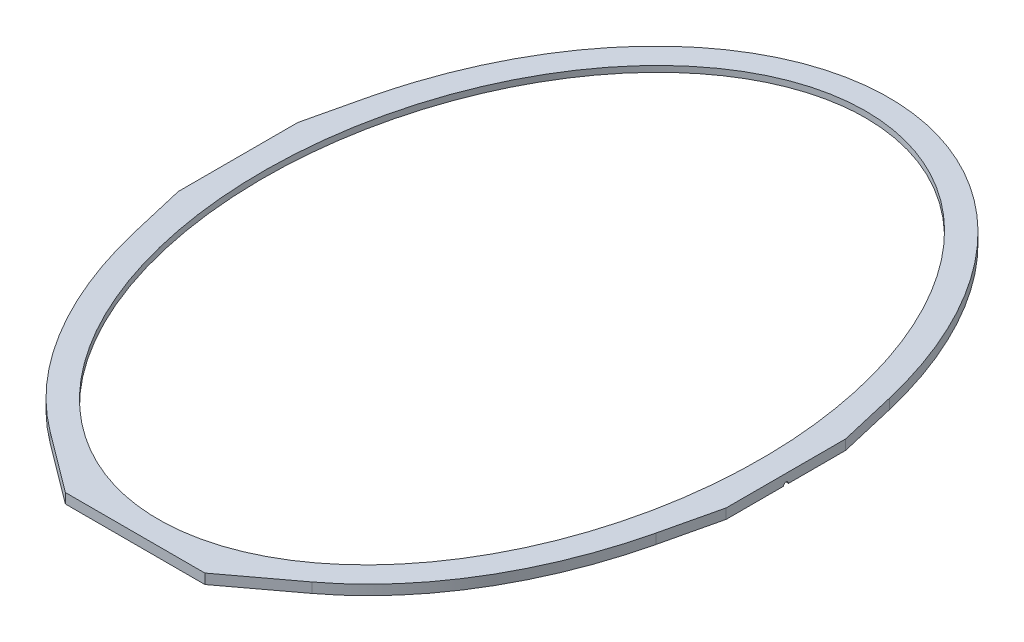
ISO-10303-21;
HEADER;
FILE_DESCRIPTION(('STEP AP214'),'2;1');
FILE_NAME('part.step','',(''),(''),'','','');
FILE_SCHEMA(('AUTOMOTIVE_DESIGN { 1 0 10303 214 1 1 1 1 }'));
ENDSEC;
DATA;
#1=APPLICATION_CONTEXT('core data for automotive mechanical design processes');
#2=APPLICATION_PROTOCOL_DEFINITION('international standard','automotive_design',2000,#1);
#3=PRODUCT_CONTEXT('',#1,'mechanical');
#4=PRODUCT('Part','Part','',(#3));
#5=PRODUCT_RELATED_PRODUCT_CATEGORY('part','',(#4));
#6=PRODUCT_DEFINITION_FORMATION('','',#4);
#7=PRODUCT_DEFINITION_CONTEXT('part definition',#1,'design');
#8=PRODUCT_DEFINITION('design','',#6,#7);
#9=PRODUCT_DEFINITION_SHAPE('','',#8);
#10=(LENGTH_UNIT() NAMED_UNIT(*) SI_UNIT(.MILLI.,.METRE.));
#11=(NAMED_UNIT(*) PLANE_ANGLE_UNIT() SI_UNIT($,.RADIAN.));
#12=(NAMED_UNIT(*) SI_UNIT($,.STERADIAN.) SOLID_ANGLE_UNIT());
#13=UNCERTAINTY_MEASURE_WITH_UNIT(LENGTH_MEASURE(1.E-05),#10,'distance_accuracy_value','');
#14=(GEOMETRIC_REPRESENTATION_CONTEXT(3) GLOBAL_UNCERTAINTY_ASSIGNED_CONTEXT((#13)) GLOBAL_UNIT_ASSIGNED_CONTEXT((#10,
#11,#12)) REPRESENTATION_CONTEXT('',''));
#15=CARTESIAN_POINT('',(0.,0.,0.));
#16=DIRECTION('',(0.,0.,1.));
#17=DIRECTION('',(1.,0.,0.));
#18=AXIS2_PLACEMENT_3D('',#15,#16,#17);
#19=CARTESIAN_POINT('',(0.,10.,0.));
#20=DIRECTION('',(0.,1.,0.));
#21=DIRECTION('',(0.,0.,1.));
#22=AXIS2_PLACEMENT_3D('',#19,#20,#21);
#23=ELLIPSE('',#22,378.303394114485,275.129741174171);
#24=DIRECTION('',(0.,-1.,0.));
#25=VECTOR('',#24,1.);
#26=SURFACE_OF_LINEAR_EXTRUSION('',#23,#25);
#27=CARTESIAN_POINT('',(0.,0.,0.));
#28=DIRECTION('',(0.,1.,0.));
#29=DIRECTION('',(0.,0.,1.));
#30=AXIS2_PLACEMENT_3D('',#27,#28,#29);
#31=ELLIPSE('',#30,378.303394114485,275.129741174171);
#32=CARTESIAN_POINT('',(-261.621621621622,0.,117.081081081081));
#33=VERTEX_POINT('',#32);
#34=CARTESIAN_POINT('',(-131.488450883328,0.,332.304138114354));
#35=VERTEX_POINT('',#34);
#36=EDGE_CURVE('E303',#33,#35,#31,.T.);
#37=ORIENTED_EDGE('',*,*,#36,.T.);
#38=DIRECTION('',(0.,1.,0.));
#39=VECTOR('',#38,1.);
#40=CARTESIAN_POINT('',(-131.488450883328,0.,332.304138114354));
#41=LINE('',#40,#39);
#42=CARTESIAN_POINT('',(-131.488450883328,10.,332.304138114354));
#43=VERTEX_POINT('',#42);
#44=EDGE_CURVE('E223',#35,#43,#41,.T.);
#45=ORIENTED_EDGE('',*,*,#44,.T.);
#46=CARTESIAN_POINT('',(-261.621621621622,10.,117.081081081081));
#47=VERTEX_POINT('',#46);
#48=EDGE_CURVE('E271',#47,#43,#23,.T.);
#49=ORIENTED_EDGE('',*,*,#48,.F.);
#50=DIRECTION('',(0.,-1.,0.));
#51=VECTOR('',#50,1.);
#52=CARTESIAN_POINT('',(-261.621621621622,10.,117.081081081081));
#53=LINE('',#52,#51);
#54=EDGE_CURVE('E306',#47,#33,#53,.T.);
#55=ORIENTED_EDGE('',*,*,#54,.T.);
#56=EDGE_LOOP('',(#37,#45,#49,#55));
#57=FACE_BOUND('',#56,.T.);
#58=ADVANCED_FACE('F32',(#57),#26,.F.);
#59=CARTESIAN_POINT('',(0.,10.,0.));
#60=DIRECTION('',(0.,1.,0.));
#61=DIRECTION('',(0.,0.,-1.));
#62=AXIS2_PLACEMENT_3D('',#59,#60,#61);
#63=ELLIPSE('',#62,355.,250.);
#64=DIRECTION('',(0.,-1.,0.));
#65=VECTOR('',#64,1.);
#66=SURFACE_OF_LINEAR_EXTRUSION('',#63,#65);
#67=CARTESIAN_POINT('',(0.,10.,-355.));
#68=VERTEX_POINT('',#67);
#69=EDGE_CURVE('E241',#68,#68,#63,.T.);
#70=ORIENTED_EDGE('',*,*,#69,.T.);
#71=EDGE_LOOP('',(#70));
#72=FACE_BOUND('',#71,.T.);
#73=CARTESIAN_POINT('',(0.,4.,0.));
#74=DIRECTION('',(0.,-1.,0.));
#75=DIRECTION('',(0.,0.,1.));
#76=AXIS2_PLACEMENT_3D('',#73,#74,#75);
#77=ELLIPSE('',#76,355.,250.);
#78=CARTESIAN_POINT('',(0.,4.,355.));
#79=VERTEX_POINT('',#78);
#80=EDGE_CURVE('E234',#79,#79,#77,.T.);
#81=ORIENTED_EDGE('',*,*,#80,.T.);
#82=EDGE_LOOP('',(#81));
#83=FACE_BOUND('',#82,.T.);
#84=ADVANCED_FACE('F252',(#72,#83),#66,.T.);
#85=CARTESIAN_POINT('',(0.,10.,0.));
#86=DIRECTION('',(0.,-1.,0.));
#87=DIRECTION('',(0.,0.,-1.));
#88=AXIS2_PLACEMENT_3D('',#85,#86,#87);
#89=PLANE('',#88);
#90=ORIENTED_EDGE('',*,*,#48,.T.);
#91=DIRECTION('',(0.800731260144117,0.,0.599023746631145));
#92=VECTOR('',#91,1.);
#93=CARTESIAN_POINT('',(-70.,10.,378.303394114484));
#94=LINE('',#93,#92);
#95=CARTESIAN_POINT('',(-70.,10.,378.303394114484));
#96=VERTEX_POINT('',#95);
#97=EDGE_CURVE('E212',#43,#96,#94,.T.);
#98=ORIENTED_EDGE('',*,*,#97,.T.);
#99=DIRECTION('',(1.,0.,0.));
#100=VECTOR('',#99,1.);
#101=CARTESIAN_POINT('',(70.,10.,378.303394114484));
#102=LINE('',#101,#100);
#103=CARTESIAN_POINT('',(70.,10.,378.303394114484));
#104=VERTEX_POINT('',#103);
#105=EDGE_CURVE('E199',#96,#104,#102,.T.);
#106=ORIENTED_EDGE('',*,*,#105,.T.);
#107=DIRECTION('',(0.800731260144117,0.,-0.599023746631145));
#108=VECTOR('',#107,1.);
#109=CARTESIAN_POINT('',(70.,10.,378.303394114484));
#110=LINE('',#109,#108);
#111=CARTESIAN_POINT('',(131.488450883328,10.,332.304138114354));
#112=VERTEX_POINT('',#111);
#113=EDGE_CURVE('E193',#104,#112,#110,.T.);
#114=ORIENTED_EDGE('',*,*,#113,.T.);
#115=CARTESIAN_POINT('',(261.621621621622,10.,117.081081081081));
#116=VERTEX_POINT('',#115);
#117=EDGE_CURVE('E270',#112,#116,#23,.T.);
#118=ORIENTED_EDGE('',*,*,#117,.T.);
#119=DIRECTION('',(0.228191322789328,0.,-0.973616310567801));
#120=VECTOR('',#119,1.);
#121=CARTESIAN_POINT('',(275.,10.,60.));
#122=LINE('',#121,#120);
#123=CARTESIAN_POINT('',(275.,10.,60.));
#124=VERTEX_POINT('',#123);
#125=EDGE_CURVE('E275',#116,#124,#122,.T.);
#126=ORIENTED_EDGE('',*,*,#125,.T.);
#127=DIRECTION('',(0.,0.,-1.));
#128=VECTOR('',#127,1.);
#129=CARTESIAN_POINT('',(275.,10.,-60.));
#130=LINE('',#129,#128);
#131=CARTESIAN_POINT('',(275.,10.,-60.));
#132=VERTEX_POINT('',#131);
#133=EDGE_CURVE('E429',#124,#132,#130,.T.);
#134=ORIENTED_EDGE('',*,*,#133,.T.);
#135=DIRECTION('',(-0.228191322789328,0.,-0.973616310567801));
#136=VECTOR('',#135,1.);
#137=CARTESIAN_POINT('',(275.,10.,-60.));
#138=LINE('',#137,#136);
#139=CARTESIAN_POINT('',(261.621621621622,10.,-117.081081081081));
#140=VERTEX_POINT('',#139);
#141=EDGE_CURVE('E373',#132,#140,#138,.T.);
#142=ORIENTED_EDGE('',*,*,#141,.T.);
#143=CARTESIAN_POINT('',(0.,10.,0.));
#144=DIRECTION('',(0.,1.,0.));
#145=DIRECTION('',(0.,0.,-1.));
#146=AXIS2_PLACEMENT_3D('',#143,#144,#145);
#147=ELLIPSE('',#146,378.303394114485,275.129741174171);
#148=CARTESIAN_POINT('',(-261.621621621622,10.,-117.081081081081));
#149=VERTEX_POINT('',#148);
#150=EDGE_CURVE('E327',#140,#149,#147,.T.);
#151=ORIENTED_EDGE('',*,*,#150,.T.);
#152=DIRECTION('',(-0.228191322789328,0.,0.973616310567801));
#153=VECTOR('',#152,1.);
#154=CARTESIAN_POINT('',(-275.,10.,-60.));
#155=LINE('',#154,#153);
#156=CARTESIAN_POINT('',(-275.,10.,-60.));
#157=VERTEX_POINT('',#156);
#158=EDGE_CURVE('E262',#149,#157,#155,.T.);
#159=ORIENTED_EDGE('',*,*,#158,.T.);
#160=DIRECTION('',(0.,0.,1.));
#161=VECTOR('',#160,1.);
#162=CARTESIAN_POINT('',(-275.,10.,-60.));
#163=LINE('',#162,#161);
#164=CARTESIAN_POINT('',(-275.,10.,60.));
#165=VERTEX_POINT('',#164);
#166=EDGE_CURVE('E265',#157,#165,#163,.T.);
#167=ORIENTED_EDGE('',*,*,#166,.T.);
#168=DIRECTION('',(0.228191322789328,0.,0.973616310567801));
#169=VECTOR('',#168,1.);
#170=CARTESIAN_POINT('',(-275.,10.,60.));
#171=LINE('',#170,#169);
#172=EDGE_CURVE('E268',#165,#47,#171,.T.);
#173=ORIENTED_EDGE('',*,*,#172,.T.);
#174=EDGE_LOOP('',(#90,#98,#106,#114,#118,#126,#134,#142,#151,#159,#167,#173));
#175=FACE_BOUND('',#174,.T.);
#176=ORIENTED_EDGE('',*,*,#69,.F.);
#177=EDGE_LOOP('',(#176));
#178=FACE_BOUND('',#177,.T.);
#179=ADVANCED_FACE('F255',(#175,#178),#89,.F.);
#180=CARTESIAN_POINT('',(0.,0.,0.));
#181=DIRECTION('',(0.,-1.,0.));
#182=DIRECTION('',(0.,0.,-1.));
#183=AXIS2_PLACEMENT_3D('',#180,#181,#182);
#184=PLANE('',#183);
#185=DIRECTION('',(1.,0.,0.));
#186=VECTOR('',#185,1.);
#187=CARTESIAN_POINT('',(265.,0.,-2.5));
#188=LINE('',#187,#186);
#189=CARTESIAN_POINT('',(265.,0.,-2.5));
#190=VERTEX_POINT('',#189);
#191=CARTESIAN_POINT('',(275.,0.,-2.5));
#192=VERTEX_POINT('',#191);
#193=EDGE_CURVE('E47',#190,#192,#188,.T.);
#194=ORIENTED_EDGE('',*,*,#193,.F.);
#195=DIRECTION('',(0.,0.,-1.));
#196=VECTOR('',#195,1.);
#197=CARTESIAN_POINT('',(265.,0.,2.5));
#198=LINE('',#197,#196);
#199=CARTESIAN_POINT('',(265.,0.,2.5));
#200=VERTEX_POINT('',#199);
#201=EDGE_CURVE('E171',#200,#190,#198,.T.);
#202=ORIENTED_EDGE('',*,*,#201,.F.);
#203=DIRECTION('',(1.,0.,0.));
#204=VECTOR('',#203,1.);
#205=CARTESIAN_POINT('',(265.,0.,2.5));
#206=LINE('',#205,#204);
#207=CARTESIAN_POINT('',(275.,0.,2.5));
#208=VERTEX_POINT('',#207);
#209=EDGE_CURVE('E161',#200,#208,#206,.T.);
#210=ORIENTED_EDGE('',*,*,#209,.T.);
#211=DIRECTION('',(0.,0.,-1.));
#212=VECTOR('',#211,1.);
#213=CARTESIAN_POINT('',(275.,0.,-60.));
#214=LINE('',#213,#212);
#215=CARTESIAN_POINT('',(275.,0.,60.));
#216=VERTEX_POINT('',#215);
#217=EDGE_CURVE('E318',#216,#208,#214,.T.);
#218=ORIENTED_EDGE('',*,*,#217,.F.);
#219=DIRECTION('',(0.228191322789328,0.,-0.973616310567801));
#220=VECTOR('',#219,1.);
#221=CARTESIAN_POINT('',(275.,0.,60.));
#222=LINE('',#221,#220);
#223=CARTESIAN_POINT('',(261.621621621622,0.,117.081081081081));
#224=VERTEX_POINT('',#223);
#225=EDGE_CURVE('E309',#224,#216,#222,.T.);
#226=ORIENTED_EDGE('',*,*,#225,.F.);
#227=CARTESIAN_POINT('',(131.488450883328,0.,332.304138114354));
#228=VERTEX_POINT('',#227);
#229=EDGE_CURVE('E310',#228,#224,#31,.T.);
#230=ORIENTED_EDGE('',*,*,#229,.F.);
#231=DIRECTION('',(0.800731260144117,0.,-0.599023746631145));
#232=VECTOR('',#231,1.);
#233=CARTESIAN_POINT('',(70.,0.,378.303394114484));
#234=LINE('',#233,#232);
#235=CARTESIAN_POINT('',(70.,0.,378.303394114484));
#236=VERTEX_POINT('',#235);
#237=EDGE_CURVE('E196',#236,#228,#234,.T.);
#238=ORIENTED_EDGE('',*,*,#237,.F.);
#239=DIRECTION('',(1.,0.,0.));
#240=VECTOR('',#239,1.);
#241=CARTESIAN_POINT('',(70.,0.,378.303394114484));
#242=LINE('',#241,#240);
#243=CARTESIAN_POINT('',(-70.,0.,378.303394114484));
#244=VERTEX_POINT('',#243);
#245=EDGE_CURVE('E207',#244,#236,#242,.T.);
#246=ORIENTED_EDGE('',*,*,#245,.F.);
#247=DIRECTION('',(0.800731260144117,0.,0.599023746631145));
#248=VECTOR('',#247,1.);
#249=CARTESIAN_POINT('',(-70.,0.,378.303394114484));
#250=LINE('',#249,#248);
#251=EDGE_CURVE('E204',#35,#244,#250,.T.);
#252=ORIENTED_EDGE('',*,*,#251,.F.);
#253=ORIENTED_EDGE('',*,*,#36,.F.);
#254=DIRECTION('',(0.228191322789328,0.,0.973616310567801));
#255=VECTOR('',#254,1.);
#256=CARTESIAN_POINT('',(-275.,0.,60.));
#257=LINE('',#256,#255);
#258=CARTESIAN_POINT('',(-275.,0.,60.));
#259=VERTEX_POINT('',#258);
#260=EDGE_CURVE('E314',#259,#33,#257,.T.);
#261=ORIENTED_EDGE('',*,*,#260,.F.);
#262=DIRECTION('',(0.,0.,1.));
#263=VECTOR('',#262,1.);
#264=CARTESIAN_POINT('',(-275.,0.,-60.));
#265=LINE('',#264,#263);
#266=CARTESIAN_POINT('',(-275.,0.,2.5));
#267=VERTEX_POINT('',#266);
#268=EDGE_CURVE('E375',#267,#259,#265,.T.);
#269=ORIENTED_EDGE('',*,*,#268,.F.);
#270=DIRECTION('',(-1.,0.,0.));
#271=VECTOR('',#270,1.);
#272=CARTESIAN_POINT('',(-265.,0.,2.5));
#273=LINE('',#272,#271);
#274=CARTESIAN_POINT('',(-265.,0.,2.5));
#275=VERTEX_POINT('',#274);
#276=EDGE_CURVE('E55',#275,#267,#273,.T.);
#277=ORIENTED_EDGE('',*,*,#276,.F.);
#278=DIRECTION('',(0.,0.,1.));
#279=VECTOR('',#278,1.);
#280=CARTESIAN_POINT('',(-265.,0.,-2.5));
#281=LINE('',#280,#279);
#282=CARTESIAN_POINT('',(-265.,0.,-2.5));
#283=VERTEX_POINT('',#282);
#284=EDGE_CURVE('E187',#283,#275,#281,.T.);
#285=ORIENTED_EDGE('',*,*,#284,.F.);
#286=DIRECTION('',(-1.,0.,0.));
#287=VECTOR('',#286,1.);
#288=CARTESIAN_POINT('',(-265.,0.,-2.5));
#289=LINE('',#288,#287);
#290=CARTESIAN_POINT('',(-275.,0.,-2.5));
#291=VERTEX_POINT('',#290);
#292=EDGE_CURVE('E190',#283,#291,#289,.T.);
#293=ORIENTED_EDGE('',*,*,#292,.T.);
#294=CARTESIAN_POINT('',(-275.,0.,-60.));
#295=VERTEX_POINT('',#294);
#296=EDGE_CURVE('E376',#295,#291,#265,.T.);
#297=ORIENTED_EDGE('',*,*,#296,.F.);
#298=DIRECTION('',(-0.228191322789328,0.,0.973616310567801));
#299=VECTOR('',#298,1.);
#300=CARTESIAN_POINT('',(-275.,0.,-60.));
#301=LINE('',#300,#299);
#302=CARTESIAN_POINT('',(-261.621621621622,0.,-117.081081081081));
#303=VERTEX_POINT('',#302);
#304=EDGE_CURVE('E261',#303,#295,#301,.T.);
#305=ORIENTED_EDGE('',*,*,#304,.F.);
#306=CARTESIAN_POINT('',(0.,0.,0.));
#307=DIRECTION('',(0.,1.,0.));
#308=DIRECTION('',(0.,0.,-1.));
#309=AXIS2_PLACEMENT_3D('',#306,#307,#308);
#310=ELLIPSE('',#309,378.303394114485,275.129741174171);
#311=CARTESIAN_POINT('',(261.621621621622,0.,-117.081081081081));
#312=VERTEX_POINT('',#311);
#313=EDGE_CURVE('E266',#312,#303,#310,.T.);
#314=ORIENTED_EDGE('',*,*,#313,.F.);
#315=DIRECTION('',(-0.228191322789328,0.,-0.973616310567801));
#316=VECTOR('',#315,1.);
#317=CARTESIAN_POINT('',(275.,0.,-60.));
#318=LINE('',#317,#316);
#319=CARTESIAN_POINT('',(275.,0.,-60.));
#320=VERTEX_POINT('',#319);
#321=EDGE_CURVE('E320',#320,#312,#318,.T.);
#322=ORIENTED_EDGE('',*,*,#321,.F.);
#323=EDGE_CURVE('E312',#192,#320,#214,.T.);
#324=ORIENTED_EDGE('',*,*,#323,.F.);
#325=EDGE_LOOP('',(#194,#202,#210,#218,#226,#230,#238,#246,#252,#253,#261,#269,#277,#285,#293,
#297,#305,#314,#322,#324));
#326=FACE_BOUND('',#325,.T.);
#327=CARTESIAN_POINT('',(0.,0.,0.));
#328=DIRECTION('',(0.,-1.,0.));
#329=DIRECTION('',(0.,0.,1.));
#330=AXIS2_PLACEMENT_3D('',#327,#328,#329);
#331=ELLIPSE('',#330,365.,260.);
#332=CARTESIAN_POINT('',(-92.6512145780915,0.,341.03856387222));
#333=VERTEX_POINT('',#332);
#334=CARTESIAN_POINT('',(92.6512145780914,0.,341.03856387222));
#335=VERTEX_POINT('',#334);
#336=EDGE_CURVE('E237',#333,#335,#331,.T.);
#337=ORIENTED_EDGE('',*,*,#336,.F.);
#338=DIRECTION('',(-0.975631014990766,0.,-0.219417689779306));
#339=VECTOR('',#338,1.);
#340=CARTESIAN_POINT('',(-131.488450883328,0.,332.304138114354));
#341=LINE('',#340,#339);
#342=CARTESIAN_POINT('',(0.,0.,361.875658168739));
#343=VERTEX_POINT('',#342);
#344=EDGE_CURVE('E201',#343,#333,#341,.T.);
#345=ORIENTED_EDGE('',*,*,#344,.F.);
#346=DIRECTION('',(-0.975631014990766,0.,0.219417689779306));
#347=VECTOR('',#346,1.);
#348=CARTESIAN_POINT('',(131.488450883328,0.,332.304138114354));
#349=LINE('',#348,#347);
#350=EDGE_CURVE('E198',#335,#343,#349,.T.);
#351=ORIENTED_EDGE('',*,*,#350,.F.);
#352=EDGE_LOOP('',(#337,#345,#351));
#353=FACE_BOUND('',#352,.T.);
#354=ADVANCED_FACE('F176',(#326,#353),#184,.T.);
#355=CARTESIAN_POINT('',(-275.,10.,-60.));
#356=DIRECTION('',(0.973616310567801,0.,0.228191322789328));
#357=DIRECTION('',(0.228191322789328,0.,-0.973616310567801));
#358=AXIS2_PLACEMENT_3D('',#355,#356,#357);
#359=PLANE('',#358);
#360=ORIENTED_EDGE('',*,*,#304,.T.);
#361=DIRECTION('',(0.,-1.,0.));
#362=VECTOR('',#361,1.);
#363=CARTESIAN_POINT('',(-275.,10.,-60.));
#364=LINE('',#363,#362);
#365=EDGE_CURVE('E343',#157,#295,#364,.T.);
#366=ORIENTED_EDGE('',*,*,#365,.F.);
#367=ORIENTED_EDGE('',*,*,#158,.F.);
#368=DIRECTION('',(0.,-1.,0.));
#369=VECTOR('',#368,1.);
#370=CARTESIAN_POINT('',(-261.621621621622,10.,-117.081081081081));
#371=LINE('',#370,#369);
#372=EDGE_CURVE('E323',#149,#303,#371,.T.);
#373=ORIENTED_EDGE('',*,*,#372,.T.);
#374=EDGE_LOOP('',(#360,#366,#367,#373));
#375=FACE_BOUND('',#374,.T.);
#376=ADVANCED_FACE('F34',(#375),#359,.F.);
#377=CARTESIAN_POINT('',(-275.,10.,-60.));
#378=DIRECTION('',(1.,0.,0.));
#379=DIRECTION('',(0.,0.,-1.));
#380=AXIS2_PLACEMENT_3D('',#377,#378,#379);
#381=PLANE('',#380);
#382=ORIENTED_EDGE('',*,*,#296,.T.);
#383=CARTESIAN_POINT('',(-275.,0.,0.));
#384=DIRECTION('',(-1.,0.,0.));
#385=DIRECTION('',(0.,0.,1.));
#386=AXIS2_PLACEMENT_3D('',#383,#384,#385);
#387=CIRCLE('',#386,2.5);
#388=EDGE_CURVE('E182',#267,#291,#387,.T.);
#389=ORIENTED_EDGE('',*,*,#388,.F.);
#390=ORIENTED_EDGE('',*,*,#268,.T.);
#391=DIRECTION('',(0.,-1.,0.));
#392=VECTOR('',#391,1.);
#393=CARTESIAN_POINT('',(-275.,10.,60.));
#394=LINE('',#393,#392);
#395=EDGE_CURVE('E340',#165,#259,#394,.T.);
#396=ORIENTED_EDGE('',*,*,#395,.F.);
#397=ORIENTED_EDGE('',*,*,#166,.F.);
#398=ORIENTED_EDGE('',*,*,#365,.T.);
#399=EDGE_LOOP('',(#382,#389,#390,#396,#397,#398));
#400=FACE_BOUND('',#399,.T.);
#401=ADVANCED_FACE('F287',(#400),#381,.F.);
#402=CARTESIAN_POINT('',(-275.,10.,60.));
#403=DIRECTION('',(0.973616310567801,0.,-0.228191322789328));
#404=DIRECTION('',(-0.228191322789328,0.,-0.973616310567801));
#405=AXIS2_PLACEMENT_3D('',#402,#403,#404);
#406=PLANE('',#405);
#407=ORIENTED_EDGE('',*,*,#260,.T.);
#408=ORIENTED_EDGE('',*,*,#54,.F.);
#409=ORIENTED_EDGE('',*,*,#172,.F.);
#410=ORIENTED_EDGE('',*,*,#395,.T.);
#411=EDGE_LOOP('',(#407,#408,#409,#410));
#412=FACE_BOUND('',#411,.T.);
#413=ADVANCED_FACE('F283',(#412),#406,.F.);
#414=ORIENTED_EDGE('',*,*,#117,.F.);
#415=DIRECTION('',(0.,1.,0.));
#416=VECTOR('',#415,1.);
#417=CARTESIAN_POINT('',(131.488450883328,0.,332.304138114354));
#418=LINE('',#417,#416);
#419=EDGE_CURVE('E209',#228,#112,#418,.T.);
#420=ORIENTED_EDGE('',*,*,#419,.F.);
#421=ORIENTED_EDGE('',*,*,#229,.T.);
#422=DIRECTION('',(0.,-1.,0.));
#423=VECTOR('',#422,1.);
#424=CARTESIAN_POINT('',(261.621621621622,10.,117.081081081081));
#425=LINE('',#424,#423);
#426=EDGE_CURVE('E336',#116,#224,#425,.T.);
#427=ORIENTED_EDGE('',*,*,#426,.F.);
#428=EDGE_LOOP('',(#414,#420,#421,#427));
#429=FACE_BOUND('',#428,.T.);
#430=ADVANCED_FACE('F278',(#429),#26,.F.);
#431=CARTESIAN_POINT('',(275.,10.,60.));
#432=DIRECTION('',(-0.973616310567801,0.,-0.228191322789328));
#433=DIRECTION('',(-0.228191322789328,0.,0.973616310567801));
#434=AXIS2_PLACEMENT_3D('',#431,#432,#433);
#435=PLANE('',#434);
#436=ORIENTED_EDGE('',*,*,#225,.T.);
#437=DIRECTION('',(0.,-1.,0.));
#438=VECTOR('',#437,1.);
#439=CARTESIAN_POINT('',(275.,10.,60.));
#440=LINE('',#439,#438);
#441=EDGE_CURVE('E333',#124,#216,#440,.T.);
#442=ORIENTED_EDGE('',*,*,#441,.F.);
#443=ORIENTED_EDGE('',*,*,#125,.F.);
#444=ORIENTED_EDGE('',*,*,#426,.T.);
#445=EDGE_LOOP('',(#436,#442,#443,#444));
#446=FACE_BOUND('',#445,.T.);
#447=ADVANCED_FACE('F282',(#446),#435,.F.);
#448=CARTESIAN_POINT('',(275.,10.,-60.));
#449=DIRECTION('',(-1.,0.,0.));
#450=DIRECTION('',(0.,0.,1.));
#451=AXIS2_PLACEMENT_3D('',#448,#449,#450);
#452=PLANE('',#451);
#453=ORIENTED_EDGE('',*,*,#217,.T.);
#454=CARTESIAN_POINT('',(275.,0.,0.));
#455=DIRECTION('',(1.,0.,0.));
#456=DIRECTION('',(0.,0.,-1.));
#457=AXIS2_PLACEMENT_3D('',#454,#455,#456);
#458=CIRCLE('',#457,2.5);
#459=EDGE_CURVE('E166',#192,#208,#458,.T.);
#460=ORIENTED_EDGE('',*,*,#459,.F.);
#461=ORIENTED_EDGE('',*,*,#323,.T.);
#462=DIRECTION('',(0.,-1.,0.));
#463=VECTOR('',#462,1.);
#464=CARTESIAN_POINT('',(275.,10.,-60.));
#465=LINE('',#464,#463);
#466=EDGE_CURVE('E330',#132,#320,#465,.T.);
#467=ORIENTED_EDGE('',*,*,#466,.F.);
#468=ORIENTED_EDGE('',*,*,#133,.F.);
#469=ORIENTED_EDGE('',*,*,#441,.T.);
#470=EDGE_LOOP('',(#453,#460,#461,#467,#468,#469));
#471=FACE_BOUND('',#470,.T.);
#472=ADVANCED_FACE('F436',(#471),#452,.F.);
#473=CARTESIAN_POINT('',(275.,10.,-60.));
#474=DIRECTION('',(-0.973616310567801,0.,0.228191322789328));
#475=DIRECTION('',(0.228191322789328,0.,0.973616310567801));
#476=AXIS2_PLACEMENT_3D('',#473,#474,#475);
#477=PLANE('',#476);
#478=ORIENTED_EDGE('',*,*,#321,.T.);
#479=DIRECTION('',(0.,-1.,0.));
#480=VECTOR('',#479,1.);
#481=CARTESIAN_POINT('',(261.621621621622,10.,-117.081081081081));
#482=LINE('',#481,#480);
#483=EDGE_CURVE('E326',#140,#312,#482,.T.);
#484=ORIENTED_EDGE('',*,*,#483,.F.);
#485=ORIENTED_EDGE('',*,*,#141,.F.);
#486=ORIENTED_EDGE('',*,*,#466,.T.);
#487=EDGE_LOOP('',(#478,#484,#485,#486));
#488=FACE_BOUND('',#487,.T.);
#489=ADVANCED_FACE('F368',(#488),#477,.F.);
#490=DIRECTION('',(0.,-1.,0.));
#491=VECTOR('',#490,1.);
#492=SURFACE_OF_LINEAR_EXTRUSION('',#147,#491);
#493=ORIENTED_EDGE('',*,*,#313,.T.);
#494=ORIENTED_EDGE('',*,*,#372,.F.);
#495=ORIENTED_EDGE('',*,*,#150,.F.);
#496=ORIENTED_EDGE('',*,*,#483,.T.);
#497=EDGE_LOOP('',(#493,#494,#495,#496));
#498=FACE_BOUND('',#497,.T.);
#499=ADVANCED_FACE('F249',(#498),#492,.F.);
#500=CARTESIAN_POINT('',(0.,4.,0.));
#501=DIRECTION('',(0.,-1.,0.));
#502=DIRECTION('',(0.,0.,1.));
#503=AXIS2_PLACEMENT_3D('',#500,#501,#502);
#504=ELLIPSE('',#503,365.,260.);
#505=DIRECTION('',(0.,-1.,0.));
#506=VECTOR('',#505,1.);
#507=SURFACE_OF_LINEAR_EXTRUSION('',#504,#506);
#508=CARTESIAN_POINT('',(-92.6512145780914,4.,341.03856387222));
#509=VERTEX_POINT('',#508);
#510=CARTESIAN_POINT('',(92.6512145780914,4.,341.03856387222));
#511=VERTEX_POINT('',#510);
#512=EDGE_CURVE('E238',#509,#511,#504,.T.);
#513=ORIENTED_EDGE('',*,*,#512,.F.);
#514=DIRECTION('',(0.,-1.,0.));
#515=VECTOR('',#514,1.);
#516=CARTESIAN_POINT('',(-92.6512145780917,4.,341.038563872219));
#517=LINE('',#516,#515);
#518=EDGE_CURVE('E232',#509,#333,#517,.T.);
#519=ORIENTED_EDGE('',*,*,#518,.T.);
#520=ORIENTED_EDGE('',*,*,#336,.T.);
#521=DIRECTION('',(0.,-1.,0.));
#522=VECTOR('',#521,1.);
#523=CARTESIAN_POINT('',(92.6512145780917,4.,341.038563872219));
#524=LINE('',#523,#522);
#525=EDGE_CURVE('E219',#335,#511,#524,.F.);
#526=ORIENTED_EDGE('',*,*,#525,.T.);
#527=EDGE_LOOP('',(#513,#519,#520,#526));
#528=FACE_BOUND('',#527,.T.);
#529=ADVANCED_FACE('F244',(#528),#507,.F.);
#530=CARTESIAN_POINT('',(0.,4.,0.));
#531=DIRECTION('',(0.,-1.,0.));
#532=DIRECTION('',(0.,0.,-1.));
#533=AXIS2_PLACEMENT_3D('',#530,#531,#532);
#534=PLANE('',#533);
#535=DIRECTION('',(0.975631014990766,0.,0.219417689779307));
#536=VECTOR('',#535,1.);
#537=CARTESIAN_POINT('',(-77.4669766825673,4.,344.453472120218));
#538=LINE('',#537,#536);
#539=CARTESIAN_POINT('',(0.,4.,361.875658168739));
#540=VERTEX_POINT('',#539);
#541=EDGE_CURVE('E11',#509,#540,#538,.T.);
#542=ORIENTED_EDGE('',*,*,#541,.F.);
#543=ORIENTED_EDGE('',*,*,#512,.T.);
#544=DIRECTION('',(0.975631014990766,0.,-0.219417689779307));
#545=VECTOR('',#544,1.);
#546=CARTESIAN_POINT('',(77.4669766825673,4.,344.453472120218));
#547=LINE('',#546,#545);
#548=EDGE_CURVE('E40',#540,#511,#547,.T.);
#549=ORIENTED_EDGE('',*,*,#548,.F.);
#550=EDGE_LOOP('',(#542,#543,#549));
#551=FACE_BOUND('',#550,.T.);
#552=ORIENTED_EDGE('',*,*,#80,.F.);
#553=EDGE_LOOP('',(#552));
#554=FACE_BOUND('',#553,.T.);
#555=ADVANCED_FACE('F248',(#551,#554),#534,.T.);
#556=CARTESIAN_POINT('',(131.488450883328,0.,332.304138114354));
#557=DIRECTION('',(-0.219417689779306,0.,-0.975631014990766));
#558=DIRECTION('',(-0.975631014990766,0.,0.219417689779307));
#559=AXIS2_PLACEMENT_3D('',#556,#557,#558);
#560=PLANE('',#559);
#561=ORIENTED_EDGE('',*,*,#525,.F.);
#562=ORIENTED_EDGE('',*,*,#350,.T.);
#563=DIRECTION('',(0.,1.,0.));
#564=VECTOR('',#563,1.);
#565=CARTESIAN_POINT('',(0.,0.,361.875658168739));
#566=LINE('',#565,#564);
#567=EDGE_CURVE('E226',#343,#540,#566,.T.);
#568=ORIENTED_EDGE('',*,*,#567,.T.);
#569=ORIENTED_EDGE('',*,*,#548,.T.);
#570=EDGE_LOOP('',(#561,#562,#568,#569));
#571=FACE_BOUND('',#570,.T.);
#572=ADVANCED_FACE('F348',(#571),#560,.T.);
#573=CARTESIAN_POINT('',(-131.488450883328,0.,332.304138114354));
#574=DIRECTION('',(0.219417689779306,0.,-0.975631014990766));
#575=DIRECTION('',(-0.975631014990766,0.,-0.219417689779307));
#576=AXIS2_PLACEMENT_3D('',#573,#574,#575);
#577=PLANE('',#576);
#578=ORIENTED_EDGE('',*,*,#518,.F.);
#579=ORIENTED_EDGE('',*,*,#541,.T.);
#580=ORIENTED_EDGE('',*,*,#567,.F.);
#581=ORIENTED_EDGE('',*,*,#344,.T.);
#582=EDGE_LOOP('',(#578,#579,#580,#581));
#583=FACE_BOUND('',#582,.T.);
#584=ADVANCED_FACE('F356',(#583),#577,.T.);
#585=CARTESIAN_POINT('',(70.,0.,378.303394114484));
#586=DIRECTION('',(0.,0.,1.));
#587=DIRECTION('',(1.,0.,0.));
#588=AXIS2_PLACEMENT_3D('',#585,#586,#587);
#589=PLANE('',#588);
#590=ORIENTED_EDGE('',*,*,#245,.T.);
#591=DIRECTION('',(0.,1.,0.));
#592=VECTOR('',#591,1.);
#593=CARTESIAN_POINT('',(70.,0.,378.303394114484));
#594=LINE('',#593,#592);
#595=EDGE_CURVE('E216',#236,#104,#594,.T.);
#596=ORIENTED_EDGE('',*,*,#595,.T.);
#597=ORIENTED_EDGE('',*,*,#105,.F.);
#598=DIRECTION('',(0.,1.,0.));
#599=VECTOR('',#598,1.);
#600=CARTESIAN_POINT('',(-70.,0.,378.303394114484));
#601=LINE('',#600,#599);
#602=EDGE_CURVE('E220',#244,#96,#601,.T.);
#603=ORIENTED_EDGE('',*,*,#602,.F.);
#604=EDGE_LOOP('',(#590,#596,#597,#603));
#605=FACE_BOUND('',#604,.T.);
#606=ADVANCED_FACE('F402',(#605),#589,.T.);
#607=CARTESIAN_POINT('',(70.,0.,378.303394114484));
#608=DIRECTION('',(0.599023746631145,0.,0.800731260144117));
#609=DIRECTION('',(0.800731260144117,0.,-0.599023746631145));
#610=AXIS2_PLACEMENT_3D('',#607,#608,#609);
#611=PLANE('',#610);
#612=ORIENTED_EDGE('',*,*,#113,.F.);
#613=ORIENTED_EDGE('',*,*,#595,.F.);
#614=ORIENTED_EDGE('',*,*,#237,.T.);
#615=ORIENTED_EDGE('',*,*,#419,.T.);
#616=EDGE_LOOP('',(#612,#613,#614,#615));
#617=FACE_BOUND('',#616,.T.);
#618=ADVANCED_FACE('F405',(#617),#611,.T.);
#619=CARTESIAN_POINT('',(-70.,0.,378.303394114484));
#620=DIRECTION('',(-0.599023746631145,0.,0.800731260144117));
#621=DIRECTION('',(0.800731260144117,0.,0.599023746631145));
#622=AXIS2_PLACEMENT_3D('',#619,#620,#621);
#623=PLANE('',#622);
#624=ORIENTED_EDGE('',*,*,#97,.F.);
#625=ORIENTED_EDGE('',*,*,#44,.F.);
#626=ORIENTED_EDGE('',*,*,#251,.T.);
#627=ORIENTED_EDGE('',*,*,#602,.T.);
#628=EDGE_LOOP('',(#624,#625,#626,#627));
#629=FACE_BOUND('',#628,.T.);
#630=ADVANCED_FACE('F398',(#629),#623,.T.);
#631=CARTESIAN_POINT('',(-265.,0.,0.));
#632=DIRECTION('',(-1.,0.,0.));
#633=DIRECTION('',(0.,0.,1.));
#634=AXIS2_PLACEMENT_3D('',#631,#632,#633);
#635=CYLINDRICAL_SURFACE('',#634,2.5);
#636=ORIENTED_EDGE('',*,*,#388,.T.);
#637=ORIENTED_EDGE('',*,*,#292,.F.);
#638=CARTESIAN_POINT('',(-265.,0.,0.));
#639=DIRECTION('',(-1.,0.,0.));
#640=DIRECTION('',(0.,0.,1.));
#641=AXIS2_PLACEMENT_3D('',#638,#639,#640);
#642=CIRCLE('',#641,2.5);
#643=EDGE_CURVE('E184',#275,#283,#642,.T.);
#644=ORIENTED_EDGE('',*,*,#643,.F.);
#645=ORIENTED_EDGE('',*,*,#276,.T.);
#646=EDGE_LOOP('',(#636,#637,#644,#645));
#647=FACE_BOUND('',#646,.T.);
#648=ADVANCED_FACE('F388',(#647),#635,.F.);
#649=CARTESIAN_POINT('',(-265.,0.,0.));
#650=DIRECTION('',(-1.,0.,0.));
#651=DIRECTION('',(0.,0.,1.));
#652=AXIS2_PLACEMENT_3D('',#649,#650,#651);
#653=PLANE('',#652);
#654=ORIENTED_EDGE('',*,*,#643,.T.);
#655=ORIENTED_EDGE('',*,*,#284,.T.);
#656=EDGE_LOOP('',(#654,#655));
#657=FACE_BOUND('',#656,.T.);
#658=ADVANCED_FACE('F390',(#657),#653,.T.);
#659=CARTESIAN_POINT('',(265.,0.,0.));
#660=DIRECTION('',(1.,0.,0.));
#661=DIRECTION('',(0.,0.,-1.));
#662=AXIS2_PLACEMENT_3D('',#659,#660,#661);
#663=CYLINDRICAL_SURFACE('',#662,2.5);
#664=ORIENTED_EDGE('',*,*,#459,.T.);
#665=ORIENTED_EDGE('',*,*,#209,.F.);
#666=CARTESIAN_POINT('',(265.,0.,0.));
#667=DIRECTION('',(1.,0.,0.));
#668=DIRECTION('',(0.,0.,-1.));
#669=AXIS2_PLACEMENT_3D('',#666,#667,#668);
#670=CIRCLE('',#669,2.5);
#671=EDGE_CURVE('E164',#190,#200,#670,.T.);
#672=ORIENTED_EDGE('',*,*,#671,.F.);
#673=ORIENTED_EDGE('',*,*,#193,.T.);
#674=EDGE_LOOP('',(#664,#665,#672,#673));
#675=FACE_BOUND('',#674,.T.);
#676=ADVANCED_FACE('F163',(#675),#663,.F.);
#677=CARTESIAN_POINT('',(265.,0.,0.));
#678=DIRECTION('',(1.,0.,0.));
#679=DIRECTION('',(0.,0.,-1.));
#680=AXIS2_PLACEMENT_3D('',#677,#678,#679);
#681=PLANE('',#680);
#682=ORIENTED_EDGE('',*,*,#671,.T.);
#683=ORIENTED_EDGE('',*,*,#201,.T.);
#684=EDGE_LOOP('',(#682,#683));
#685=FACE_BOUND('',#684,.T.);
#686=ADVANCED_FACE('F174',(#685),#681,.T.);
#687=CLOSED_SHELL('',(#58,#84,#179,#354,#376,#401,#413,#430,#447,#472,#489,#499,#529,#555,#572,
#584,#606,#618,#630,#648,#658,#676,#686));
#688=MANIFOLD_SOLID_BREP('B2',#687);
#689=ADVANCED_BREP_SHAPE_REPRESENTATION('',(#18,#688),#14);
#690=SHAPE_DEFINITION_REPRESENTATION(#9,#689);
ENDSEC;
END-ISO-10303-21;
